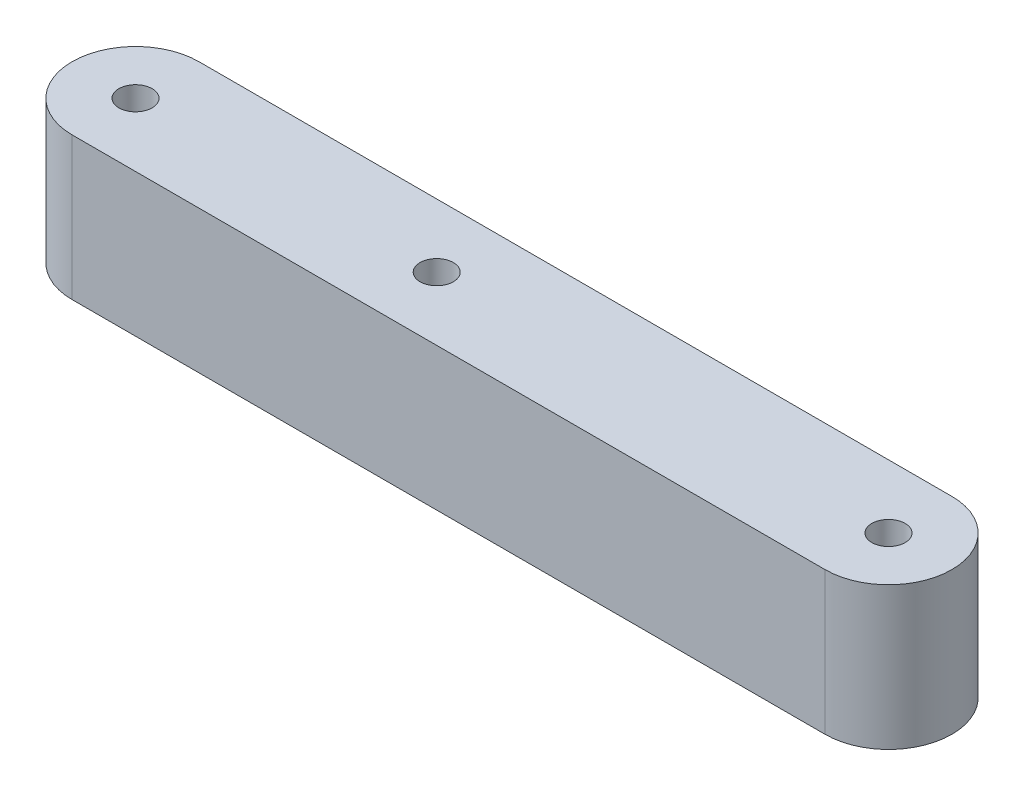
ISO-10303-21;
HEADER;
FILE_DESCRIPTION(('STEP AP214'),'2;1');
FILE_NAME('part.step','',(''),(''),'','','');
FILE_SCHEMA(('AUTOMOTIVE_DESIGN { 1 0 10303 214 1 1 1 1 }'));
ENDSEC;
DATA;
#1=APPLICATION_CONTEXT('core data for automotive mechanical design processes');
#2=APPLICATION_PROTOCOL_DEFINITION('international standard','automotive_design',2000,#1);
#3=PRODUCT_CONTEXT('',#1,'mechanical');
#4=PRODUCT('Part','Part','',(#3));
#5=PRODUCT_RELATED_PRODUCT_CATEGORY('part','',(#4));
#6=PRODUCT_DEFINITION_FORMATION('','',#4);
#7=PRODUCT_DEFINITION_CONTEXT('part definition',#1,'design');
#8=PRODUCT_DEFINITION('design','',#6,#7);
#9=PRODUCT_DEFINITION_SHAPE('','',#8);
#10=(LENGTH_UNIT() NAMED_UNIT(*) SI_UNIT(.MILLI.,.METRE.));
#11=(NAMED_UNIT(*) PLANE_ANGLE_UNIT() SI_UNIT($,.RADIAN.));
#12=(NAMED_UNIT(*) SI_UNIT($,.STERADIAN.) SOLID_ANGLE_UNIT());
#13=UNCERTAINTY_MEASURE_WITH_UNIT(LENGTH_MEASURE(1.E-05),#10,'distance_accuracy_value','');
#14=(GEOMETRIC_REPRESENTATION_CONTEXT(3) GLOBAL_UNCERTAINTY_ASSIGNED_CONTEXT((#13)) GLOBAL_UNIT_ASSIGNED_CONTEXT((#10,
#11,#12)) REPRESENTATION_CONTEXT('',''));
#15=CARTESIAN_POINT('',(0.,0.,0.));
#16=DIRECTION('',(0.,0.,1.));
#17=DIRECTION('',(1.,0.,0.));
#18=AXIS2_PLACEMENT_3D('',#15,#16,#17);
#19=CARTESIAN_POINT('',(0.,9.,4.));
#20=DIRECTION('',(0.,-1.,0.));
#21=DIRECTION('',(0.,0.,-1.));
#22=AXIS2_PLACEMENT_3D('',#19,#20,#21);
#23=CYLINDRICAL_SURFACE('',#22,4.);
#24=CARTESIAN_POINT('',(0.,0.,4.));
#25=DIRECTION('',(0.,1.,0.));
#26=DIRECTION('',(0.,0.,1.));
#27=AXIS2_PLACEMENT_3D('',#24,#25,#26);
#28=CIRCLE('',#27,4.);
#29=CARTESIAN_POINT('',(0.,0.,0.));
#30=VERTEX_POINT('',#29);
#31=CARTESIAN_POINT('',(0.,0.,8.));
#32=VERTEX_POINT('',#31);
#33=EDGE_CURVE('E98',#30,#32,#28,.T.);
#34=ORIENTED_EDGE('',*,*,#33,.T.);
#35=DIRECTION('',(0.,-1.,0.));
#36=VECTOR('',#35,1.);
#37=CARTESIAN_POINT('',(0.,9.,8.));
#38=LINE('',#37,#36);
#39=CARTESIAN_POINT('',(0.,9.,8.));
#40=VERTEX_POINT('',#39);
#41=EDGE_CURVE('E11',#40,#32,#38,.T.);
#42=ORIENTED_EDGE('',*,*,#41,.F.);
#43=CARTESIAN_POINT('',(0.,9.,4.));
#44=DIRECTION('',(0.,1.,0.));
#45=DIRECTION('',(0.,0.,1.));
#46=AXIS2_PLACEMENT_3D('',#43,#44,#45);
#47=CIRCLE('',#46,4.);
#48=CARTESIAN_POINT('',(0.,9.,0.));
#49=VERTEX_POINT('',#48);
#50=EDGE_CURVE('E84',#49,#40,#47,.T.);
#51=ORIENTED_EDGE('',*,*,#50,.F.);
#52=DIRECTION('',(0.,-1.,0.));
#53=VECTOR('',#52,1.);
#54=CARTESIAN_POINT('',(0.,9.,0.));
#55=LINE('',#54,#53);
#56=EDGE_CURVE('E51',#49,#30,#55,.T.);
#57=ORIENTED_EDGE('',*,*,#56,.T.);
#58=EDGE_LOOP('',(#34,#42,#51,#57));
#59=FACE_BOUND('',#58,.T.);
#60=ADVANCED_FACE('F35',(#59),#23,.T.);
#61=CARTESIAN_POINT('',(0.,9.,8.));
#62=DIRECTION('',(0.,0.,-1.));
#63=DIRECTION('',(-1.,0.,0.));
#64=AXIS2_PLACEMENT_3D('',#61,#62,#63);
#65=PLANE('',#64);
#66=DIRECTION('',(1.,0.,0.));
#67=VECTOR('',#66,1.);
#68=CARTESIAN_POINT('',(0.,0.,8.));
#69=LINE('',#68,#67);
#70=CARTESIAN_POINT('',(47.5,0.,8.));
#71=VERTEX_POINT('',#70);
#72=EDGE_CURVE('E89',#32,#71,#69,.T.);
#73=ORIENTED_EDGE('',*,*,#72,.T.);
#74=DIRECTION('',(0.,-1.,0.));
#75=VECTOR('',#74,1.);
#76=CARTESIAN_POINT('',(47.5,9.,8.));
#77=LINE('',#76,#75);
#78=CARTESIAN_POINT('',(47.5,9.,8.));
#79=VERTEX_POINT('',#78);
#80=EDGE_CURVE('E43',#79,#71,#77,.T.);
#81=ORIENTED_EDGE('',*,*,#80,.F.);
#82=DIRECTION('',(1.,0.,0.));
#83=VECTOR('',#82,1.);
#84=CARTESIAN_POINT('',(0.,9.,8.));
#85=LINE('',#84,#83);
#86=EDGE_CURVE('E77',#40,#79,#85,.T.);
#87=ORIENTED_EDGE('',*,*,#86,.F.);
#88=ORIENTED_EDGE('',*,*,#41,.T.);
#89=EDGE_LOOP('',(#73,#81,#87,#88));
#90=FACE_BOUND('',#89,.T.);
#91=ADVANCED_FACE('F88',(#90),#65,.F.);
#92=CARTESIAN_POINT('',(47.5,9.,4.));
#93=DIRECTION('',(0.,-1.,0.));
#94=DIRECTION('',(0.,0.,-1.));
#95=AXIS2_PLACEMENT_3D('',#92,#93,#94);
#96=CYLINDRICAL_SURFACE('',#95,4.);
#97=CARTESIAN_POINT('',(47.5,0.,4.));
#98=DIRECTION('',(0.,1.,0.));
#99=DIRECTION('',(0.,0.,1.));
#100=AXIS2_PLACEMENT_3D('',#97,#98,#99);
#101=CIRCLE('',#100,4.);
#102=CARTESIAN_POINT('',(47.5,0.,0.));
#103=VERTEX_POINT('',#102);
#104=EDGE_CURVE('E102',#71,#103,#101,.T.);
#105=ORIENTED_EDGE('',*,*,#104,.T.);
#106=DIRECTION('',(0.,-1.,0.));
#107=VECTOR('',#106,1.);
#108=CARTESIAN_POINT('',(47.5,9.,0.));
#109=LINE('',#108,#107);
#110=CARTESIAN_POINT('',(47.5,9.,0.));
#111=VERTEX_POINT('',#110);
#112=EDGE_CURVE('E66',#111,#103,#109,.T.);
#113=ORIENTED_EDGE('',*,*,#112,.F.);
#114=CARTESIAN_POINT('',(47.5,9.,4.));
#115=DIRECTION('',(0.,1.,0.));
#116=DIRECTION('',(0.,0.,1.));
#117=AXIS2_PLACEMENT_3D('',#114,#115,#116);
#118=CIRCLE('',#117,4.);
#119=EDGE_CURVE('E83',#79,#111,#118,.T.);
#120=ORIENTED_EDGE('',*,*,#119,.F.);
#121=ORIENTED_EDGE('',*,*,#80,.T.);
#122=EDGE_LOOP('',(#105,#113,#120,#121));
#123=FACE_BOUND('',#122,.T.);
#124=ADVANCED_FACE('F92',(#123),#96,.T.);
#125=CARTESIAN_POINT('',(0.,9.,0.));
#126=DIRECTION('',(0.,0.,-1.));
#127=DIRECTION('',(-1.,0.,0.));
#128=AXIS2_PLACEMENT_3D('',#125,#126,#127);
#129=PLANE('',#128);
#130=DIRECTION('',(1.,0.,0.));
#131=VECTOR('',#130,1.);
#132=CARTESIAN_POINT('',(0.,0.,0.));
#133=LINE('',#132,#131);
#134=EDGE_CURVE('E104',#30,#103,#133,.T.);
#135=ORIENTED_EDGE('',*,*,#134,.F.);
#136=ORIENTED_EDGE('',*,*,#56,.F.);
#137=DIRECTION('',(1.,0.,0.));
#138=VECTOR('',#137,1.);
#139=CARTESIAN_POINT('',(0.,9.,0.));
#140=LINE('',#139,#138);
#141=EDGE_CURVE('E93',#49,#111,#140,.T.);
#142=ORIENTED_EDGE('',*,*,#141,.T.);
#143=ORIENTED_EDGE('',*,*,#112,.T.);
#144=EDGE_LOOP('',(#135,#136,#142,#143));
#145=FACE_BOUND('',#144,.T.);
#146=ADVANCED_FACE('F145',(#145),#129,.T.);
#147=CARTESIAN_POINT('',(0.,9.,4.));
#148=DIRECTION('',(0.,1.,0.));
#149=DIRECTION('',(0.,0.,1.));
#150=AXIS2_PLACEMENT_3D('',#147,#148,#149);
#151=PLANE('',#150);
#152=CARTESIAN_POINT('',(0.,9.,4.));
#153=DIRECTION('',(0.,-1.,0.));
#154=DIRECTION('',(0.,0.,-1.));
#155=AXIS2_PLACEMENT_3D('',#152,#153,#154);
#156=CIRCLE('',#155,1.05);
#157=CARTESIAN_POINT('',(0.,9.,2.95));
#158=VERTEX_POINT('',#157);
#159=EDGE_CURVE('E100',#158,#158,#156,.T.);
#160=ORIENTED_EDGE('',*,*,#159,.T.);
#161=EDGE_LOOP('',(#160));
#162=FACE_BOUND('',#161,.T.);
#163=CARTESIAN_POINT('',(19.,9.,4.));
#164=DIRECTION('',(0.,-1.,0.));
#165=DIRECTION('',(0.,0.,-1.));
#166=AXIS2_PLACEMENT_3D('',#163,#164,#165);
#167=CIRCLE('',#166,1.05);
#168=CARTESIAN_POINT('',(19.,9.,2.95));
#169=VERTEX_POINT('',#168);
#170=EDGE_CURVE('E119',#169,#169,#167,.T.);
#171=ORIENTED_EDGE('',*,*,#170,.T.);
#172=EDGE_LOOP('',(#171));
#173=FACE_BOUND('',#172,.T.);
#174=CARTESIAN_POINT('',(47.5,9.,4.));
#175=DIRECTION('',(0.,-1.,0.));
#176=DIRECTION('',(0.,0.,-1.));
#177=AXIS2_PLACEMENT_3D('',#174,#175,#176);
#178=CIRCLE('',#177,1.05);
#179=CARTESIAN_POINT('',(47.5,9.,2.95));
#180=VERTEX_POINT('',#179);
#181=EDGE_CURVE('E113',#180,#180,#178,.T.);
#182=ORIENTED_EDGE('',*,*,#181,.T.);
#183=EDGE_LOOP('',(#182));
#184=FACE_BOUND('',#183,.T.);
#185=ORIENTED_EDGE('',*,*,#50,.T.);
#186=ORIENTED_EDGE('',*,*,#86,.T.);
#187=ORIENTED_EDGE('',*,*,#119,.T.);
#188=ORIENTED_EDGE('',*,*,#141,.F.);
#189=EDGE_LOOP('',(#185,#186,#187,#188));
#190=FACE_BOUND('',#189,.T.);
#191=ADVANCED_FACE('F80',(#162,#173,#184,#190),#151,.T.);
#192=CARTESIAN_POINT('',(0.,0.,4.));
#193=DIRECTION('',(0.,1.,0.));
#194=DIRECTION('',(0.,0.,1.));
#195=AXIS2_PLACEMENT_3D('',#192,#193,#194);
#196=PLANE('',#195);
#197=CARTESIAN_POINT('',(0.,0.,4.));
#198=DIRECTION('',(0.,-1.,0.));
#199=DIRECTION('',(0.,0.,-1.));
#200=AXIS2_PLACEMENT_3D('',#197,#198,#199);
#201=CIRCLE('',#200,1.05);
#202=CARTESIAN_POINT('',(0.,0.,2.95));
#203=VERTEX_POINT('',#202);
#204=EDGE_CURVE('E122',#203,#203,#201,.T.);
#205=ORIENTED_EDGE('',*,*,#204,.F.);
#206=EDGE_LOOP('',(#205));
#207=FACE_BOUND('',#206,.T.);
#208=CARTESIAN_POINT('',(19.,0.,4.));
#209=DIRECTION('',(0.,-1.,0.));
#210=DIRECTION('',(0.,0.,-1.));
#211=AXIS2_PLACEMENT_3D('',#208,#209,#210);
#212=CIRCLE('',#211,1.05);
#213=CARTESIAN_POINT('',(19.,0.,2.95));
#214=VERTEX_POINT('',#213);
#215=EDGE_CURVE('E116',#214,#214,#212,.T.);
#216=ORIENTED_EDGE('',*,*,#215,.F.);
#217=EDGE_LOOP('',(#216));
#218=FACE_BOUND('',#217,.T.);
#219=CARTESIAN_POINT('',(47.5,0.,4.));
#220=DIRECTION('',(0.,-1.,0.));
#221=DIRECTION('',(0.,0.,-1.));
#222=AXIS2_PLACEMENT_3D('',#219,#220,#221);
#223=CIRCLE('',#222,1.05);
#224=CARTESIAN_POINT('',(47.5,0.,2.95));
#225=VERTEX_POINT('',#224);
#226=EDGE_CURVE('E110',#225,#225,#223,.T.);
#227=ORIENTED_EDGE('',*,*,#226,.F.);
#228=EDGE_LOOP('',(#227));
#229=FACE_BOUND('',#228,.T.);
#230=ORIENTED_EDGE('',*,*,#33,.F.);
#231=ORIENTED_EDGE('',*,*,#134,.T.);
#232=ORIENTED_EDGE('',*,*,#104,.F.);
#233=ORIENTED_EDGE('',*,*,#72,.F.);
#234=EDGE_LOOP('',(#230,#231,#232,#233));
#235=FACE_BOUND('',#234,.T.);
#236=ADVANCED_FACE('F137',(#207,#218,#229,#235),#196,.F.);
#237=CARTESIAN_POINT('',(47.5,9.,4.));
#238=DIRECTION('',(0.,-1.,0.));
#239=DIRECTION('',(0.,0.,-1.));
#240=AXIS2_PLACEMENT_3D('',#237,#238,#239);
#241=CYLINDRICAL_SURFACE('',#240,1.05);
#242=ORIENTED_EDGE('',*,*,#181,.F.);
#243=EDGE_LOOP('',(#242));
#244=FACE_BOUND('',#243,.T.);
#245=ORIENTED_EDGE('',*,*,#226,.T.);
#246=EDGE_LOOP('',(#245));
#247=FACE_BOUND('',#246,.T.);
#248=ADVANCED_FACE('F140',(#244,#247),#241,.F.);
#249=CARTESIAN_POINT('',(19.,9.,4.));
#250=DIRECTION('',(0.,-1.,0.));
#251=DIRECTION('',(0.,0.,-1.));
#252=AXIS2_PLACEMENT_3D('',#249,#250,#251);
#253=CYLINDRICAL_SURFACE('',#252,1.05);
#254=ORIENTED_EDGE('',*,*,#170,.F.);
#255=EDGE_LOOP('',(#254));
#256=FACE_BOUND('',#255,.T.);
#257=ORIENTED_EDGE('',*,*,#215,.T.);
#258=EDGE_LOOP('',(#257));
#259=FACE_BOUND('',#258,.T.);
#260=ADVANCED_FACE('F133',(#256,#259),#253,.F.);
#261=CARTESIAN_POINT('',(0.,9.,4.));
#262=DIRECTION('',(0.,-1.,0.));
#263=DIRECTION('',(0.,0.,-1.));
#264=AXIS2_PLACEMENT_3D('',#261,#262,#263);
#265=CYLINDRICAL_SURFACE('',#264,1.05);
#266=ORIENTED_EDGE('',*,*,#159,.F.);
#267=EDGE_LOOP('',(#266));
#268=FACE_BOUND('',#267,.T.);
#269=ORIENTED_EDGE('',*,*,#204,.T.);
#270=EDGE_LOOP('',(#269));
#271=FACE_BOUND('',#270,.T.);
#272=ADVANCED_FACE('F130',(#268,#271),#265,.F.);
#273=CLOSED_SHELL('',(#60,#91,#124,#146,#191,#236,#248,#260,#272));
#274=MANIFOLD_SOLID_BREP('B2',#273);
#275=ADVANCED_BREP_SHAPE_REPRESENTATION('',(#18,#274),#14);
#276=SHAPE_DEFINITION_REPRESENTATION(#9,#275);
ENDSEC;
END-ISO-10303-21;
